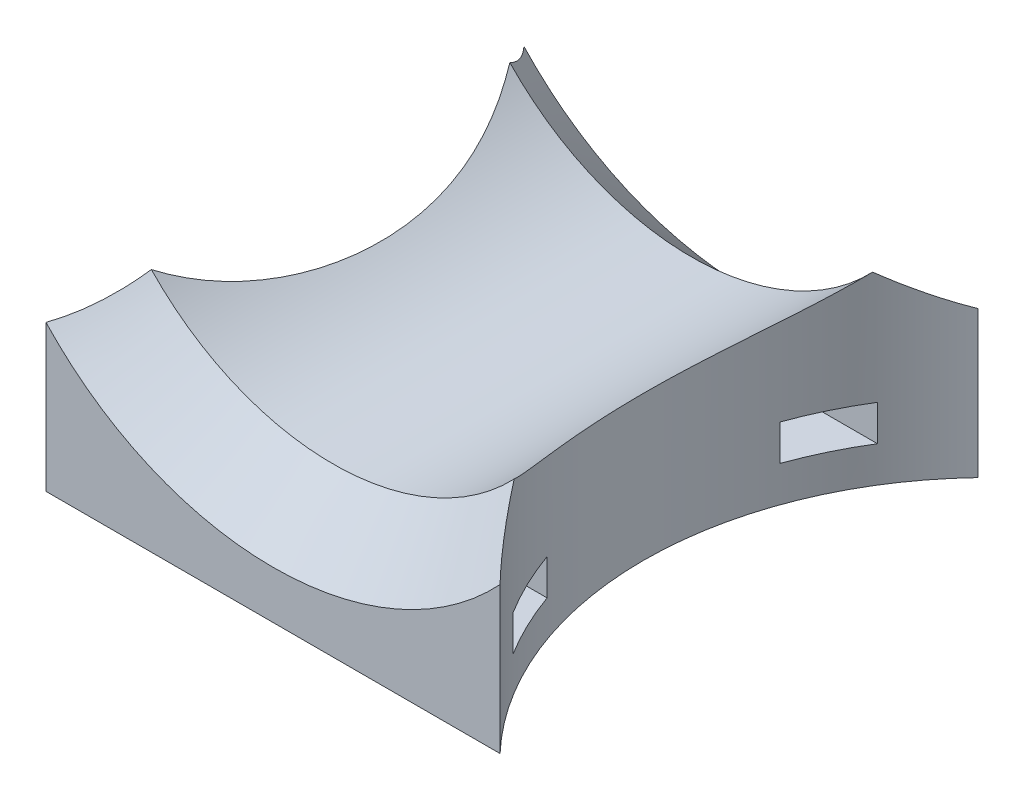
ISO-10303-21;
HEADER;
FILE_DESCRIPTION(('STEP AP214'),'2;1');
FILE_NAME('part.step','',(''),(''),'','','');
FILE_SCHEMA(('AUTOMOTIVE_DESIGN { 1 0 10303 214 1 1 1 1 }'));
ENDSEC;
DATA;
#1=APPLICATION_CONTEXT('core data for automotive mechanical design processes');
#2=APPLICATION_PROTOCOL_DEFINITION('international standard','automotive_design',2000,#1);
#3=PRODUCT_CONTEXT('',#1,'mechanical');
#4=PRODUCT('Part','Part','',(#3));
#5=PRODUCT_RELATED_PRODUCT_CATEGORY('part','',(#4));
#6=PRODUCT_DEFINITION_FORMATION('','',#4);
#7=PRODUCT_DEFINITION_CONTEXT('part definition',#1,'design');
#8=PRODUCT_DEFINITION('design','',#6,#7);
#9=PRODUCT_DEFINITION_SHAPE('','',#8);
#10=(LENGTH_UNIT() NAMED_UNIT(*) SI_UNIT(.MILLI.,.METRE.));
#11=(NAMED_UNIT(*) PLANE_ANGLE_UNIT() SI_UNIT($,.RADIAN.));
#12=(NAMED_UNIT(*) SI_UNIT($,.STERADIAN.) SOLID_ANGLE_UNIT());
#13=UNCERTAINTY_MEASURE_WITH_UNIT(LENGTH_MEASURE(1.E-05),#10,'distance_accuracy_value','');
#14=(GEOMETRIC_REPRESENTATION_CONTEXT(3) GLOBAL_UNCERTAINTY_ASSIGNED_CONTEXT((#13)) GLOBAL_UNIT_ASSIGNED_CONTEXT((#10,
#11,#12)) REPRESENTATION_CONTEXT('',''));
#15=CARTESIAN_POINT('',(0.,0.,0.));
#16=DIRECTION('',(0.,0.,1.));
#17=DIRECTION('',(1.,0.,0.));
#18=AXIS2_PLACEMENT_3D('',#15,#16,#17);
#19=CARTESIAN_POINT('',(40.,-30.,0.));
#20=DIRECTION('',(0.,1.,0.));
#21=DIRECTION('',(0.,0.,1.));
#22=AXIS2_PLACEMENT_3D('',#19,#20,#21);
#23=CYLINDRICAL_SURFACE('',#22,29.);
#24=DIRECTION('',(0.,1.,0.));
#25=VECTOR('',#24,1.);
#26=CARTESIAN_POINT('',(12.6881436002603,-30.,9.75));
#27=LINE('',#26,#25);
#28=CARTESIAN_POINT('',(12.6881436002603,-24.,9.75));
#29=VERTEX_POINT('',#28);
#30=CARTESIAN_POINT('',(12.6881436002603,-27.,9.75));
#31=VERTEX_POINT('',#30);
#32=EDGE_CURVE('E201',#29,#31,#27,.F.);
#33=ORIENTED_EDGE('',*,*,#32,.T.);
#34=CARTESIAN_POINT('',(40.,-27.,0.));
#35=DIRECTION('',(0.,1.,0.));
#36=DIRECTION('',(0.,0.,1.));
#37=AXIS2_PLACEMENT_3D('',#34,#35,#36);
#38=CIRCLE('',#37,29.);
#39=CARTESIAN_POINT('',(15.3334740995008,-27.,15.25));
#40=VERTEX_POINT('',#39);
#41=EDGE_CURVE('E211',#31,#40,#38,.T.);
#42=ORIENTED_EDGE('',*,*,#41,.T.);
#43=DIRECTION('',(0.,1.,0.));
#44=VECTOR('',#43,1.);
#45=CARTESIAN_POINT('',(15.3334740995008,-30.,15.25));
#46=LINE('',#45,#44);
#47=CARTESIAN_POINT('',(15.3334740995008,-24.,15.25));
#48=VERTEX_POINT('',#47);
#49=EDGE_CURVE('E195',#40,#48,#46,.T.);
#50=ORIENTED_EDGE('',*,*,#49,.T.);
#51=CARTESIAN_POINT('',(40.,-24.,0.));
#52=DIRECTION('',(0.,-1.,0.));
#53=DIRECTION('',(0.,0.,-1.));
#54=AXIS2_PLACEMENT_3D('',#51,#52,#53);
#55=CIRCLE('',#54,29.);
#56=EDGE_CURVE('E198',#48,#29,#55,.T.);
#57=ORIENTED_EDGE('',*,*,#56,.T.);
#58=EDGE_LOOP('',(#33,#42,#50,#57));
#59=FACE_BOUND('',#58,.T.);
#60=DIRECTION('',(0.,1.,0.));
#61=VECTOR('',#60,1.);
#62=CARTESIAN_POINT('',(19.,-30.,-20.));
#63=LINE('',#62,#61);
#64=CARTESIAN_POINT('',(19.,-17.7482393492989,-20.));
#65=VERTEX_POINT('',#64);
#66=CARTESIAN_POINT('',(19.,-30.,-20.));
#67=VERTEX_POINT('',#66);
#68=EDGE_CURVE('E276',#65,#67,#63,.F.);
#69=ORIENTED_EDGE('',*,*,#68,.F.);
#70=CARTESIAN_POINT('',(19.,-17.7482393492989,-20.));
#71=CARTESIAN_POINT('',(18.8045868262512,-17.6568386119846,-19.7948205300674));
#72=CARTESIAN_POINT('',(18.613792274645,-17.558432853422,-19.5884607847409));
#73=CARTESIAN_POINT('',(18.2414622058741,-17.3488873673357,-19.1740331252359));
#74=CARTESIAN_POINT('',(18.0599227060194,-17.2377531851807,-18.9659659913146));
#75=CARTESIAN_POINT('',(17.7072974501951,-17.0048321764659,-18.5501797511942));
#76=CARTESIAN_POINT('',(17.5361428460741,-16.8831325454134,-18.3424699760893));
#77=CARTESIAN_POINT('',(17.2026486547946,-16.6293968709386,-17.9262907582243));
#78=CARTESIAN_POINT('',(17.0403100065065,-16.4973597302472,-17.7178212370667));
#79=CARTESIAN_POINT('',(16.5664148326756,-16.0872901704774,-17.0921237510885));
#80=CARTESIAN_POINT('',(16.2677073430761,-15.7951167988339,-16.6742844913208));
#81=CARTESIAN_POINT('',(15.8431358588016,-15.3320259528604,-16.0471297615558));
#82=CARTESIAN_POINT('',(15.7050299337098,-15.1728470912157,-15.8371843397159));
#83=CARTESIAN_POINT('',(15.4368788195647,-14.847029754763,-15.4180059454303));
#84=CARTESIAN_POINT('',(15.3068321916517,-14.6803926207136,-15.2087728521502));
#85=CARTESIAN_POINT('',(15.1806527080183,-14.5102647583887,-15.));
#86=B_SPLINE_CURVE_WITH_KNOTS('',3,(#70,#71,#72,#73,#74,#75,#76,#77,#78,#79,#80,#81,#82,#83,#84,
#85),.UNSPECIFIED.,.F.,.F.,(4,2,2,2,2,2,2,4),(0.,0.892949133559846,1.78551070693732,
2.67130209931057,3.5571876413128,5.32758477733651,6.2198416880776,7.11193883882122),.UNSPECIFIED.);
#87=CARTESIAN_POINT('',(15.1806527080181,-14.5102647583889,-15.0000000000001));
#88=VERTEX_POINT('',#87);
#89=EDGE_CURVE('E43',#65,#88,#86,.T.);
#90=ORIENTED_EDGE('',*,*,#89,.T.);
#91=CARTESIAN_POINT('',(19.,-8.94427190999912,20.));
#92=CARTESIAN_POINT('',(18.9039114104774,-9.14840743725538,19.8991068690403));
#93=CARTESIAN_POINT('',(18.8053033896162,-9.34932262649657,19.7941126506236));
#94=CARTESIAN_POINT('',(18.6036605591897,-9.7443783318733,19.5759730503217));
#95=CARTESIAN_POINT('',(18.5006259651156,-9.93851917696075,19.4628280650454));
#96=CARTESIAN_POINT('',(18.2907985257648,-10.3195923818707,19.2285017453362));
#97=CARTESIAN_POINT('',(18.1840080820448,-10.5065291933814,19.1073255039098));
#98=CARTESIAN_POINT('',(17.9672562491902,-10.8730425341803,18.856978523071));
#99=CARTESIAN_POINT('',(17.8572948412191,-11.0526190197307,18.7278077361635));
#100=CARTESIAN_POINT('',(17.5252191395533,-11.5774395529795,18.3303763519549));
#101=CARTESIAN_POINT('',(17.2993376085445,-11.911607659895,18.0504547416309));
#102=CARTESIAN_POINT('',(16.8427786652544,-12.5488889902828,17.4608744387475));
#103=CARTESIAN_POINT('',(16.6121008456218,-12.8519995629555,17.1512132122372));
#104=CARTESIAN_POINT('',(16.1513426043052,-13.4264473782888,16.5045103112492));
#105=CARTESIAN_POINT('',(15.9212618273074,-13.6978366585375,16.1675150608426));
#106=CARTESIAN_POINT('',(15.4659868994628,-14.209879431563,15.467914660408));
#107=CARTESIAN_POINT('',(15.240792764503,-14.4505328244276,15.1053094271363));
#108=CARTESIAN_POINT('',(14.79919496961,-14.9024761721936,14.3564823488737));
#109=CARTESIAN_POINT('',(14.5828020957074,-15.113730823054,13.970232897821));
#110=CARTESIAN_POINT('',(14.1626930221293,-15.5080997957494,13.1770640079171));
#111=CARTESIAN_POINT('',(13.9589772884338,-15.6912130835409,12.7701438102581));
#112=CARTESIAN_POINT('',(13.5545110573638,-16.0421801762605,11.9111645457387));
#113=CARTESIAN_POINT('',(13.3548128461404,-16.208269991036,11.4578903868487));
#114=CARTESIAN_POINT('',(12.9761582064399,-16.5129763702693,10.5338201388379));
#115=CARTESIAN_POINT('',(12.7972024469182,-16.6515920487733,10.0630234852535));
#116=CARTESIAN_POINT('',(12.4622633404053,-16.903726280157,9.10658564357133));
#117=CARTESIAN_POINT('',(12.3062885832434,-17.0172354566443,8.62093898633375));
#118=CARTESIAN_POINT('',(12.0191333405289,-17.2212494430627,7.63763893565968));
#119=CARTESIAN_POINT('',(11.8879545150981,-17.3117527128564,7.13998474081558));
#120=CARTESIAN_POINT('',(11.6305841121916,-17.4859343793409,6.04534777563613));
#121=CARTESIAN_POINT('',(11.5094739029761,-17.5655022197232,5.44650862418814));
#122=CARTESIAN_POINT('',(11.3050239009771,-17.6977745699956,4.23947808919503));
#123=CARTESIAN_POINT('',(11.2216878287998,-17.7504764337546,3.6312857904984));
#124=CARTESIAN_POINT('',(11.0936845261808,-17.8307567752484,2.40889082375661));
#125=CARTESIAN_POINT('',(11.0490369808312,-17.8583224638297,1.79468525663936));
#126=CARTESIAN_POINT('',(10.9989460356161,-17.8892151423947,0.564070250599289));
#127=CARTESIAN_POINT('',(10.9935040268294,-17.8925412723179,-0.0523392657470109));
#128=CARTESIAN_POINT('',(11.0234523382865,-17.8741144391611,-1.35165825138968));
#129=CARTESIAN_POINT('',(11.0633965028398,-17.8495647160325,-2.03443001010268));
#130=CARTESIAN_POINT('',(11.1911699881013,-17.7697316034707,-3.39372887311614));
#131=CARTESIAN_POINT('',(11.2790036182874,-17.7144454481184,-4.070255409849));
#132=CARTESIAN_POINT('',(11.5014493950904,-17.5708342097346,-5.4125417879236));
#133=CARTESIAN_POINT('',(11.6360929441077,-17.4824869446343,-6.07829408681049));
#134=CARTESIAN_POINT('',(11.9500910619762,-17.2693752217973,-7.39320787113809));
#135=CARTESIAN_POINT('',(12.1294431932539,-17.1446127494044,-8.04237025895688));
#136=CARTESIAN_POINT('',(12.5279934893706,-16.8555463825094,-9.31276528954861));
#137=CARTESIAN_POINT('',(12.7468159850251,-16.6916109182299,-9.93419766856104));
#138=CARTESIAN_POINT('',(13.1022798210491,-16.4119727951245,-10.8452419807606));
#139=CARTESIAN_POINT('',(13.2253378072631,-16.3131107628211,-11.145473205202));
#140=CARTESIAN_POINT('',(13.4798099731396,-16.103475763495,-11.7381175733682));
#141=CARTESIAN_POINT('',(13.6112229692148,-15.9927044820308,-12.0305318161623));
#142=CARTESIAN_POINT('',(13.8813252403014,-15.758827656012,-12.6061787342028));
#143=CARTESIAN_POINT('',(14.0200002207393,-15.6357459386378,-12.8894277938743));
#144=CARTESIAN_POINT('',(14.3038900093229,-15.3764652407931,-13.4464731598977));
#145=CARTESIAN_POINT('',(14.4491044043148,-15.2402670883886,-13.7202700615023));
#146=CARTESIAN_POINT('',(14.7449093423514,-14.954261577987,-14.2574310747668));
#147=CARTESIAN_POINT('',(14.8954967698859,-14.8044620312383,-14.5208010513296));
#148=CARTESIAN_POINT('',(15.2009275844927,-14.4906781986373,-15.036484646203));
#149=CARTESIAN_POINT('',(15.3557719774269,-14.3266905403324,-15.2887956142443));
#150=CARTESIAN_POINT('',(15.7309813376667,-13.9155185299175,-15.8802252807279));
#151=CARTESIAN_POINT('',(15.9527458638638,-13.661321145354,-16.2136311579146));
#152=CARTESIAN_POINT('',(16.397762462832,-13.1238353987813,-16.8548726377232));
#153=CARTESIAN_POINT('',(16.6210141680451,-12.8405539924303,-17.162714322501));
#154=CARTESIAN_POINT('',(17.064231683216,-12.2453825550541,-17.7506577356234));
#155=CARTESIAN_POINT('',(17.2842024605884,-11.9335422888836,-18.0308060133564));
#156=CARTESIAN_POINT('',(17.7165501262211,-11.2816966391159,-18.5624684004249));
#157=CARTESIAN_POINT('',(17.9289304251155,-10.9417041388772,-18.8139954839717));
#158=CARTESIAN_POINT('',(18.2871333498749,-10.3281895519589,-19.2251125672963));
#159=CARTESIAN_POINT('',(18.4357383510364,-10.0607826217684,-19.3914553626246));
#160=CARTESIAN_POINT('',(18.7245561009047,-9.51247760502896,-19.7079004962586));
#161=CARTESIAN_POINT('',(18.8647744616447,-9.23158877216572,-19.858013750354));
#162=CARTESIAN_POINT('',(19.,-8.94427190999916,-20.));
#163=B_SPLINE_CURVE_WITH_KNOTS('',3,(#91,#92,#93,#94,#95,#96,#97,#98,#99,#100,#101,#102,#103,
#104,#105,#106,#107,#108,#109,#110,#111,#112,#113,#114,#115,#116,#117,#118,#119,#120,#121,#122,
#123,#124,#125,#126,#127,#128,#129,#130,#131,#132,#133,#134,#135,#136,#137,#138,#139,#140,#141,
#142,#143,#144,#145,#146,#147,#148,#149,#150,#151,#152,#153,#154,#155,#156,#157,#158,#159,#160,
#161,#162),.UNSPECIFIED.,.F.,.F.,(4,2,2,2,2,2,2,2,2,2,2,2,2,2,2,2,2,2,2,2,2,2,2,2,2,2,2,2,2,2,2,
2,2,2,2,4),(0.,0.741376253193113,1.48271645603477,2.22359095614536,2.96446985817628,
4.43522826864416,5.90611210580667,7.37454810307057,8.84298887361083,10.3131781070179,
11.7834213490437,13.3491728119809,14.9149747572227,16.4813604905413,18.0478510584215,
19.8943074066758,21.7409455842339,23.5885227981666,25.4361655669436,27.4868925306678,
29.537804065697,31.5900941166277,33.6422722983437,35.6758604956514,36.6931264329757,
37.7102485820949,38.7254388214263,39.7405650117771,40.7551118611018,41.7699005298379,
43.1911875229068,44.6121353930285,46.0306526849984,47.448524368541,48.4924893238795,
49.5357476948665),.UNSPECIFIED.);
#164=CARTESIAN_POINT('',(15.1806527080183,-14.5102647583887,15.));
#165=VERTEX_POINT('',#164);
#166=EDGE_CURVE('E217',#165,#88,#163,.T.);
#167=ORIENTED_EDGE('',*,*,#166,.F.);
#168=CARTESIAN_POINT('',(15.1806527080183,-14.5102647583887,15.));
#169=CARTESIAN_POINT('',(15.2915368513939,-14.6597763376227,15.1834684326013));
#170=CARTESIAN_POINT('',(15.405415575833,-14.8065943315214,15.3673018820033));
#171=CARTESIAN_POINT('',(15.6393741766288,-15.0945237395815,15.7355499106167));
#172=CARTESIAN_POINT('',(15.7594550820458,-15.2356341997835,15.9199645814668));
#173=CARTESIAN_POINT('',(16.1298394682152,-15.6504980378453,16.474629419991));
#174=CARTESIAN_POINT('',(16.389767259395,-15.9150804669532,16.8454396077148));
#175=CARTESIAN_POINT('',(16.9322095706892,-16.4119438078037,17.580745215584));
#176=CARTESIAN_POINT('',(17.2143110512324,-16.6446622183528,17.9452493432718));
#177=CARTESIAN_POINT('',(17.8053324743054,-17.0775548326277,18.671243285544));
#178=CARTESIAN_POINT('',(18.1142162749407,-17.2777718787671,19.0327364624892));
#179=CARTESIAN_POINT('',(18.5283197235269,-17.5101789308391,19.4932224614779));
#180=CARTESIAN_POINT('',(18.6209783385757,-17.560017200726,19.5948081468966));
#181=CARTESIAN_POINT('',(18.8087147945036,-17.6565558870561,19.7976908000885));
#182=CARTESIAN_POINT('',(18.9037974462781,-17.7032492638384,19.8989866638933));
#183=CARTESIAN_POINT('',(19.,-17.7482393492988,20.));
#184=B_SPLINE_CURVE_WITH_KNOTS('',3,(#168,#169,#170,#171,#172,#173,#174,#175,#176,#177,#178,
#179,#180,#181,#182,#183),.UNSPECIFIED.,.F.,.F.,(4,2,2,2,2,2,2,4),(0.,0.784017331878552,
1.56816516772788,3.14013216086747,4.68770814272012,6.23322728947603,6.67193826107007,
7.11160069075822),.UNSPECIFIED.);
#185=CARTESIAN_POINT('',(19.,-17.7482393492988,20.));
#186=VERTEX_POINT('',#185);
#187=EDGE_CURVE('E246',#165,#186,#184,.T.);
#188=ORIENTED_EDGE('',*,*,#187,.T.);
#189=DIRECTION('',(0.,1.,0.));
#190=VECTOR('',#189,1.);
#191=CARTESIAN_POINT('',(19.,-30.,20.));
#192=LINE('',#191,#190);
#193=CARTESIAN_POINT('',(19.,-30.,20.));
#194=VERTEX_POINT('',#193);
#195=EDGE_CURVE('E225',#186,#194,#192,.F.);
#196=ORIENTED_EDGE('',*,*,#195,.T.);
#197=CARTESIAN_POINT('',(40.,-30.,0.));
#198=DIRECTION('',(0.,1.,0.));
#199=DIRECTION('',(0.,0.,-1.));
#200=AXIS2_PLACEMENT_3D('',#197,#198,#199);
#201=CIRCLE('',#200,29.);
#202=EDGE_CURVE('E214',#67,#194,#201,.T.);
#203=ORIENTED_EDGE('',*,*,#202,.F.);
#204=EDGE_LOOP('',(#69,#90,#167,#188,#196,#203));
#205=FACE_BOUND('',#204,.T.);
#206=DIRECTION('',(0.,1.,0.));
#207=VECTOR('',#206,1.);
#208=CARTESIAN_POINT('',(15.3334740995007,-30.,-15.25));
#209=LINE('',#208,#207);
#210=CARTESIAN_POINT('',(15.3334740995007,-24.,-15.25));
#211=VERTEX_POINT('',#210);
#212=CARTESIAN_POINT('',(15.3334740995007,-27.,-15.25));
#213=VERTEX_POINT('',#212);
#214=EDGE_CURVE('E145',#211,#213,#209,.F.);
#215=ORIENTED_EDGE('',*,*,#214,.T.);
#216=CARTESIAN_POINT('',(40.,-27.,0.));
#217=DIRECTION('',(0.,1.,0.));
#218=DIRECTION('',(0.,0.,1.));
#219=AXIS2_PLACEMENT_3D('',#216,#217,#218);
#220=CIRCLE('',#219,29.);
#221=CARTESIAN_POINT('',(12.6881436002603,-27.,-9.75));
#222=VERTEX_POINT('',#221);
#223=EDGE_CURVE('E148',#213,#222,#220,.T.);
#224=ORIENTED_EDGE('',*,*,#223,.T.);
#225=DIRECTION('',(0.,1.,0.));
#226=VECTOR('',#225,1.);
#227=CARTESIAN_POINT('',(12.6881436002603,-30.,-9.75));
#228=LINE('',#227,#226);
#229=CARTESIAN_POINT('',(12.6881436002603,-24.,-9.75));
#230=VERTEX_POINT('',#229);
#231=EDGE_CURVE('E171',#222,#230,#228,.T.);
#232=ORIENTED_EDGE('',*,*,#231,.T.);
#233=CARTESIAN_POINT('',(40.,-24.,0.));
#234=DIRECTION('',(0.,-1.,0.));
#235=DIRECTION('',(0.,0.,-1.));
#236=AXIS2_PLACEMENT_3D('',#233,#234,#235);
#237=CIRCLE('',#236,29.);
#238=EDGE_CURVE('E174',#230,#211,#237,.T.);
#239=ORIENTED_EDGE('',*,*,#238,.T.);
#240=EDGE_LOOP('',(#215,#224,#232,#239));
#241=FACE_BOUND('',#240,.T.);
#242=ADVANCED_FACE('F33',(#59,#205,#241),#23,.F.);
#243=CARTESIAN_POINT('',(-27.5,-30.,20.));
#244=DIRECTION('',(0.,1.,0.));
#245=DIRECTION('',(0.,0.,1.));
#246=AXIS2_PLACEMENT_3D('',#243,#244,#245);
#247=PLANE('',#246);
#248=CARTESIAN_POINT('',(0.,-30.,-12.5));
#249=DIRECTION('',(0.,-1.,0.));
#250=DIRECTION('',(0.,0.,1.));
#251=AXIS2_PLACEMENT_3D('',#248,#249,#250);
#252=CIRCLE('',#251,1.8);
#253=CARTESIAN_POINT('',(0.,-30.,-10.7));
#254=VERTEX_POINT('',#253);
#255=EDGE_CURVE('E380',#254,#254,#252,.T.);
#256=ORIENTED_EDGE('',*,*,#255,.F.);
#257=EDGE_LOOP('',(#256));
#258=FACE_BOUND('',#257,.T.);
#259=CARTESIAN_POINT('',(0.,-30.,12.5));
#260=DIRECTION('',(0.,-1.,0.));
#261=DIRECTION('',(0.,0.,-1.));
#262=AXIS2_PLACEMENT_3D('',#259,#260,#261);
#263=CIRCLE('',#262,1.8);
#264=CARTESIAN_POINT('',(0.,-30.,10.7));
#265=VERTEX_POINT('',#264);
#266=EDGE_CURVE('E165',#265,#265,#263,.T.);
#267=ORIENTED_EDGE('',*,*,#266,.F.);
#268=EDGE_LOOP('',(#267));
#269=FACE_BOUND('',#268,.T.);
#270=DIRECTION('',(1.,0.,0.));
#271=VECTOR('',#270,1.);
#272=CARTESIAN_POINT('',(-27.5,-30.,-20.));
#273=LINE('',#272,#271);
#274=CARTESIAN_POINT('',(-19.,-30.,-20.));
#275=VERTEX_POINT('',#274);
#276=EDGE_CURVE('E282',#275,#67,#273,.T.);
#277=ORIENTED_EDGE('',*,*,#276,.T.);
#278=ORIENTED_EDGE('',*,*,#202,.T.);
#279=DIRECTION('',(1.,0.,0.));
#280=VECTOR('',#279,1.);
#281=CARTESIAN_POINT('',(-27.5,-30.,20.));
#282=LINE('',#281,#280);
#283=CARTESIAN_POINT('',(-19.,-30.,20.));
#284=VERTEX_POINT('',#283);
#285=EDGE_CURVE('E281',#284,#194,#282,.T.);
#286=ORIENTED_EDGE('',*,*,#285,.F.);
#287=CARTESIAN_POINT('',(-40.,-30.,0.));
#288=DIRECTION('',(0.,1.,0.));
#289=DIRECTION('',(0.,0.,1.));
#290=AXIS2_PLACEMENT_3D('',#287,#288,#289);
#291=CIRCLE('',#290,29.);
#292=EDGE_CURVE('E295',#284,#275,#291,.T.);
#293=ORIENTED_EDGE('',*,*,#292,.T.);
#294=EDGE_LOOP('',(#277,#278,#286,#293));
#295=FACE_BOUND('',#294,.T.);
#296=ADVANCED_FACE('F235',(#258,#269,#295),#247,.F.);
#297=CARTESIAN_POINT('',(0.,0.,20.));
#298=DIRECTION('',(0.,0.,-1.));
#299=DIRECTION('',(-1.,0.,0.));
#300=AXIS2_PLACEMENT_3D('',#297,#298,#299);
#301=CYLINDRICAL_SURFACE('',#300,21.);
#302=ORIENTED_EDGE('',*,*,#166,.T.);
#303=CARTESIAN_POINT('',(0.,0.,-15.));
#304=DIRECTION('',(0.,0.,1.));
#305=DIRECTION('',(1.,0.,0.));
#306=AXIS2_PLACEMENT_3D('',#303,#304,#305);
#307=CIRCLE('',#306,21.);
#308=CARTESIAN_POINT('',(-15.1806527080183,-14.5102647583887,-15.));
#309=VERTEX_POINT('',#308);
#310=EDGE_CURVE('E271',#88,#309,#307,.F.);
#311=ORIENTED_EDGE('',*,*,#310,.T.);
#312=CARTESIAN_POINT('',(-19.,-8.94427190999918,-20.));
#313=CARTESIAN_POINT('',(-18.9039114104774,-9.14840743725543,-19.8991068690403));
#314=CARTESIAN_POINT('',(-18.8053033896162,-9.34932262649663,-19.7941126506236));
#315=CARTESIAN_POINT('',(-18.6036605591897,-9.74437833187335,-19.5759730503217));
#316=CARTESIAN_POINT('',(-18.5006259651156,-9.9385191769608,-19.4628280650453));
#317=CARTESIAN_POINT('',(-18.2907985257648,-10.3195923818708,-19.2285017453362));
#318=CARTESIAN_POINT('',(-18.1840080820447,-10.5065291933814,-19.1073255039098));
#319=CARTESIAN_POINT('',(-17.9672562491901,-10.8730425341803,-18.856978523071));
#320=CARTESIAN_POINT('',(-17.8572948412191,-11.0526190197307,-18.7278077361635));
#321=CARTESIAN_POINT('',(-17.5252191395533,-11.5774395529795,-18.3303763519549));
#322=CARTESIAN_POINT('',(-17.2993376085445,-11.9116076598951,-18.0504547416308));
#323=CARTESIAN_POINT('',(-16.8427786652544,-12.5488889902829,-17.4608744387475));
#324=CARTESIAN_POINT('',(-16.6121008456218,-12.8519995629555,-17.1512132122372));
#325=CARTESIAN_POINT('',(-16.1513426043052,-13.4264473782888,-16.5045103112492));
#326=CARTESIAN_POINT('',(-15.9212618273073,-13.6978366585376,-16.1675150608426));
#327=CARTESIAN_POINT('',(-15.4659868994628,-14.209879431563,-15.4679146604079));
#328=CARTESIAN_POINT('',(-15.2407927645029,-14.4505328244276,-15.1053094271362));
#329=CARTESIAN_POINT('',(-14.7991949696099,-14.9024761721936,-14.3564823488737));
#330=CARTESIAN_POINT('',(-14.5828020957074,-15.113730823054,-13.9702328978209));
#331=CARTESIAN_POINT('',(-14.1626930221293,-15.5080997957494,-13.177064007917));
#332=CARTESIAN_POINT('',(-13.9589772884338,-15.691213083541,-12.7701438102581));
#333=CARTESIAN_POINT('',(-13.5545110573637,-16.0421801762605,-11.9111645457386));
#334=CARTESIAN_POINT('',(-13.3548128461403,-16.2082699910361,-11.4578903868487));
#335=CARTESIAN_POINT('',(-12.9761582064398,-16.5129763702693,-10.5338201388378));
#336=CARTESIAN_POINT('',(-12.7972024469182,-16.6515920487733,-10.0630234852534));
#337=CARTESIAN_POINT('',(-12.4622633404053,-16.9037262801571,-9.10658564357126));
#338=CARTESIAN_POINT('',(-12.3062885832434,-17.0172354566444,-8.62093898633367));
#339=CARTESIAN_POINT('',(-12.0191333405289,-17.2212494430627,-7.6376389356596));
#340=CARTESIAN_POINT('',(-11.887954515098,-17.3117527128564,-7.1399847408155));
#341=CARTESIAN_POINT('',(-11.6305841121916,-17.4859343793409,-6.04534777563604));
#342=CARTESIAN_POINT('',(-11.5094739029761,-17.5655022197232,-5.44650862418805));
#343=CARTESIAN_POINT('',(-11.3050239009771,-17.6977745699956,-4.23947808919494));
#344=CARTESIAN_POINT('',(-11.2216878287998,-17.7504764337546,-3.63128579049831));
#345=CARTESIAN_POINT('',(-11.0936845261808,-17.8307567752484,-2.40889082375651));
#346=CARTESIAN_POINT('',(-11.0490369808312,-17.8583224638297,-1.79468525663927));
#347=CARTESIAN_POINT('',(-10.9989460356161,-17.8892151423947,-0.564070250599192));
#348=CARTESIAN_POINT('',(-10.9935040268294,-17.8925412723179,0.0523392657471083));
#349=CARTESIAN_POINT('',(-11.0234523382866,-17.8741144391611,1.35165825138978));
#350=CARTESIAN_POINT('',(-11.0633965028398,-17.8495647160325,2.03443001010278));
#351=CARTESIAN_POINT('',(-11.1911699881013,-17.7697316034707,3.39372887311624));
#352=CARTESIAN_POINT('',(-11.2790036182874,-17.7144454481184,4.07025540984909));
#353=CARTESIAN_POINT('',(-11.5014493950904,-17.5708342097346,5.4125417879237));
#354=CARTESIAN_POINT('',(-11.6360929441077,-17.4824869446343,6.07829408681058));
#355=CARTESIAN_POINT('',(-11.9500910619762,-17.2693752217973,7.39320787113818));
#356=CARTESIAN_POINT('',(-12.129443193254,-17.1446127494044,8.04237025895698));
#357=CARTESIAN_POINT('',(-12.5279934893707,-16.8555463825094,9.3127652895487));
#358=CARTESIAN_POINT('',(-12.7468159850251,-16.6916109182299,9.93419766856113));
#359=CARTESIAN_POINT('',(-13.1022798210492,-16.4119727951244,10.8452419807607));
#360=CARTESIAN_POINT('',(-13.2253378072632,-16.3131107628211,11.1454732052021));
#361=CARTESIAN_POINT('',(-13.4798099731397,-16.103475763495,11.7381175733683));
#362=CARTESIAN_POINT('',(-13.6112229692148,-15.9927044820307,12.0305318161624));
#363=CARTESIAN_POINT('',(-13.8813252403015,-15.758827656012,12.6061787342029));
#364=CARTESIAN_POINT('',(-14.0200002207394,-15.6357459386378,12.8894277938744));
#365=CARTESIAN_POINT('',(-14.3038900093229,-15.376465240793,13.4464731598978));
#366=CARTESIAN_POINT('',(-14.4491044043148,-15.2402670883886,13.7202700615023));
#367=CARTESIAN_POINT('',(-14.7449093423515,-14.9542615779869,14.2574310747669));
#368=CARTESIAN_POINT('',(-14.8954967698859,-14.8044620312383,14.5208010513297));
#369=CARTESIAN_POINT('',(-15.2009275844927,-14.4906781986372,15.036484646203));
#370=CARTESIAN_POINT('',(-15.355771977427,-14.3266905403323,15.2887956142444));
#371=CARTESIAN_POINT('',(-15.7309813376667,-13.9155185299175,15.8802252807279));
#372=CARTESIAN_POINT('',(-15.9527458638638,-13.6613211453539,16.2136311579147));
#373=CARTESIAN_POINT('',(-16.3977624628321,-13.1238353987812,16.8548726377233));
#374=CARTESIAN_POINT('',(-16.6210141680452,-12.8405539924303,17.1627143225011));
#375=CARTESIAN_POINT('',(-17.064231683216,-12.2453825550541,17.7506577356234));
#376=CARTESIAN_POINT('',(-17.2842024605885,-11.9335422888835,18.0308060133564));
#377=CARTESIAN_POINT('',(-17.7165501262211,-11.2816966391158,18.562468400425));
#378=CARTESIAN_POINT('',(-17.9289304251155,-10.9417041388772,18.8139954839718));
#379=CARTESIAN_POINT('',(-18.2871333498749,-10.3281895519588,19.2251125672964));
#380=CARTESIAN_POINT('',(-18.4357383510364,-10.0607826217683,19.3914553626246));
#381=CARTESIAN_POINT('',(-18.7245561009047,-9.51247760502894,19.7079004962586));
#382=CARTESIAN_POINT('',(-18.8647744616447,-9.23158877216571,19.858013750354));
#383=CARTESIAN_POINT('',(-19.,-8.94427190999917,20.));
#384=B_SPLINE_CURVE_WITH_KNOTS('',3,(#312,#313,#314,#315,#316,#317,#318,#319,#320,#321,#322,
#323,#324,#325,#326,#327,#328,#329,#330,#331,#332,#333,#334,#335,#336,#337,#338,#339,#340,#341,
#342,#343,#344,#345,#346,#347,#348,#349,#350,#351,#352,#353,#354,#355,#356,#357,#358,#359,#360,
#361,#362,#363,#364,#365,#366,#367,#368,#369,#370,#371,#372,#373,#374,#375,#376,#377,#378,#379,
#380,#381,#382,#383),.UNSPECIFIED.,.F.,.F.,(4,2,2,2,2,2,2,2,2,2,2,2,2,2,2,2,2,2,2,2,2,2,2,2,2,2,
2,2,2,2,2,2,2,2,2,4),(0.,0.741376253193117,1.48271645603477,2.22359095614535,2.96446985817628,
4.43522826864416,5.90611210580668,7.37454810307059,8.84298887361084,10.3131781070179,
11.7834213490437,13.349172811981,14.9149747572228,16.4813604905413,18.0478510584216,
19.8943074066758,21.740945584234,23.5885227981667,25.4361655669437,27.4868925306678,
29.537804065697,31.5900941166278,33.6422722983437,35.6758604956515,36.6931264329758,
37.710248582095,38.7254388214264,39.7405650117771,40.7551118611019,41.769900529838,
43.1911875229068,44.6121353930285,46.0306526849985,47.448524368541,48.4924893238795,
49.5357476948664),.UNSPECIFIED.);
#385=CARTESIAN_POINT('',(-15.1806527080183,-14.5102647583887,15.));
#386=VERTEX_POINT('',#385);
#387=EDGE_CURVE('E290',#309,#386,#384,.T.);
#388=ORIENTED_EDGE('',*,*,#387,.T.);
#389=CARTESIAN_POINT('',(0.,0.,15.));
#390=DIRECTION('',(0.,0.,1.));
#391=DIRECTION('',(1.,0.,0.));
#392=AXIS2_PLACEMENT_3D('',#389,#390,#391);
#393=CIRCLE('',#392,21.);
#394=EDGE_CURVE('E274',#386,#165,#393,.T.);
#395=ORIENTED_EDGE('',*,*,#394,.T.);
#396=EDGE_LOOP('',(#302,#311,#388,#395));
#397=FACE_BOUND('',#396,.T.);
#398=ADVANCED_FACE('F227',(#397),#301,.F.);
#399=CARTESIAN_POINT('',(0.,0.,20.));
#400=DIRECTION('',(0.,0.,1.));
#401=DIRECTION('',(1.,0.,0.));
#402=AXIS2_PLACEMENT_3D('',#399,#400,#401);
#403=PLANE('',#402);
#404=ORIENTED_EDGE('',*,*,#195,.F.);
#405=CARTESIAN_POINT('',(0.,0.,20.));
#406=DIRECTION('',(0.,0.,1.));
#407=DIRECTION('',(1.,0.,0.));
#408=AXIS2_PLACEMENT_3D('',#405,#406,#407);
#409=CIRCLE('',#408,26.);
#410=CARTESIAN_POINT('',(-19.,-17.7482393492988,20.));
#411=VERTEX_POINT('',#410);
#412=EDGE_CURVE('E11',#186,#411,#409,.F.);
#413=ORIENTED_EDGE('',*,*,#412,.T.);
#414=DIRECTION('',(0.,1.,0.));
#415=VECTOR('',#414,1.);
#416=CARTESIAN_POINT('',(-19.,-30.,20.));
#417=LINE('',#416,#415);
#418=EDGE_CURVE('E285',#284,#411,#417,.T.);
#419=ORIENTED_EDGE('',*,*,#418,.F.);
#420=ORIENTED_EDGE('',*,*,#285,.T.);
#421=EDGE_LOOP('',(#404,#413,#419,#420));
#422=FACE_BOUND('',#421,.T.);
#423=ADVANCED_FACE('F310',(#422),#403,.T.);
#424=CARTESIAN_POINT('',(0.,0.,-20.));
#425=DIRECTION('',(0.,0.,1.));
#426=DIRECTION('',(1.,0.,0.));
#427=AXIS2_PLACEMENT_3D('',#424,#425,#426);
#428=PLANE('',#427);
#429=DIRECTION('',(0.,1.,0.));
#430=VECTOR('',#429,1.);
#431=CARTESIAN_POINT('',(-19.,-30.,-20.));
#432=LINE('',#431,#430);
#433=CARTESIAN_POINT('',(-19.,-17.7482393492989,-20.));
#434=VERTEX_POINT('',#433);
#435=EDGE_CURVE('E278',#275,#434,#432,.T.);
#436=ORIENTED_EDGE('',*,*,#435,.T.);
#437=CARTESIAN_POINT('',(0.,0.,-20.));
#438=DIRECTION('',(0.,0.,1.));
#439=DIRECTION('',(1.,0.,0.));
#440=AXIS2_PLACEMENT_3D('',#437,#438,#439);
#441=CIRCLE('',#440,26.);
#442=EDGE_CURVE('E251',#434,#65,#441,.T.);
#443=ORIENTED_EDGE('',*,*,#442,.T.);
#444=ORIENTED_EDGE('',*,*,#68,.T.);
#445=ORIENTED_EDGE('',*,*,#276,.F.);
#446=EDGE_LOOP('',(#436,#443,#444,#445));
#447=FACE_BOUND('',#446,.T.);
#448=ADVANCED_FACE('F315',(#447),#428,.F.);
#449=CARTESIAN_POINT('',(-40.,-30.,0.));
#450=DIRECTION('',(0.,1.,0.));
#451=DIRECTION('',(0.,0.,1.));
#452=AXIS2_PLACEMENT_3D('',#449,#450,#451);
#453=CYLINDRICAL_SURFACE('',#452,29.);
#454=ORIENTED_EDGE('',*,*,#387,.F.);
#455=CARTESIAN_POINT('',(-15.1806527080183,-14.5102647583887,-15.));
#456=CARTESIAN_POINT('',(-15.2915368513939,-14.6597763376227,-15.1834684326014));
#457=CARTESIAN_POINT('',(-15.405415575833,-14.8065943315214,-15.3673018820033));
#458=CARTESIAN_POINT('',(-15.6393741766288,-15.0945237395815,-15.7355499106167));
#459=CARTESIAN_POINT('',(-15.7594550820458,-15.2356341997835,-15.9199645814668));
#460=CARTESIAN_POINT('',(-16.1298394682152,-15.6504980378453,-16.474629419991));
#461=CARTESIAN_POINT('',(-16.389767259395,-15.9150804669532,-16.8454396077148));
#462=CARTESIAN_POINT('',(-16.9322095706892,-16.4119438078037,-17.580745215584));
#463=CARTESIAN_POINT('',(-17.2143110512324,-16.6446622183528,-17.9452493432718));
#464=CARTESIAN_POINT('',(-17.8053324743054,-17.0775548326278,-18.671243285544));
#465=CARTESIAN_POINT('',(-18.1142162749407,-17.2777718787671,-19.0327364624892));
#466=CARTESIAN_POINT('',(-18.5283197235269,-17.5101789308391,-19.4932224614779));
#467=CARTESIAN_POINT('',(-18.6209783385757,-17.560017200726,-19.5948081468966));
#468=CARTESIAN_POINT('',(-18.8087147945036,-17.6565558870561,-19.7976908000885));
#469=CARTESIAN_POINT('',(-18.9037974462781,-17.7032492638384,-19.8989866638933));
#470=CARTESIAN_POINT('',(-19.,-17.7482393492989,-20.));
#471=B_SPLINE_CURVE_WITH_KNOTS('',3,(#455,#456,#457,#458,#459,#460,#461,#462,#463,#464,#465,
#466,#467,#468,#469,#470),.UNSPECIFIED.,.F.,.F.,(4,2,2,2,2,2,2,4),(0.,0.784017331878547,
1.56816516772788,3.14013216086746,4.68770814272011,6.23322728947602,6.67193826107006,
7.11160069075821),.UNSPECIFIED.);
#472=EDGE_CURVE('E261',#309,#434,#471,.T.);
#473=ORIENTED_EDGE('',*,*,#472,.T.);
#474=ORIENTED_EDGE('',*,*,#435,.F.);
#475=ORIENTED_EDGE('',*,*,#292,.F.);
#476=ORIENTED_EDGE('',*,*,#418,.T.);
#477=CARTESIAN_POINT('',(-19.,-17.7482393492988,20.));
#478=CARTESIAN_POINT('',(-18.8045868262512,-17.6568386119846,19.7948205300674));
#479=CARTESIAN_POINT('',(-18.613792274645,-17.558432853422,19.5884607847409));
#480=CARTESIAN_POINT('',(-18.2414622058741,-17.3488873673357,19.1740331252359));
#481=CARTESIAN_POINT('',(-18.0599227060194,-17.2377531851806,18.9659659913146));
#482=CARTESIAN_POINT('',(-17.7072974501951,-17.0048321764658,18.5501797511942));
#483=CARTESIAN_POINT('',(-17.5361428460741,-16.8831325454134,18.3424699760893));
#484=CARTESIAN_POINT('',(-17.2026486547946,-16.6293968709386,17.9262907582243));
#485=CARTESIAN_POINT('',(-17.0403100065065,-16.4973597302472,17.7178212370666));
#486=CARTESIAN_POINT('',(-16.5664148326756,-16.0872901704774,17.0921237510885));
#487=CARTESIAN_POINT('',(-16.2677073430761,-15.7951167988339,16.6742844913208));
#488=CARTESIAN_POINT('',(-15.8431358588016,-15.3320259528604,16.0471297615558));
#489=CARTESIAN_POINT('',(-15.7050299337098,-15.1728470912157,15.8371843397159));
#490=CARTESIAN_POINT('',(-15.4368788195647,-14.847029754763,15.4180059454303));
#491=CARTESIAN_POINT('',(-15.3068321916517,-14.6803926207136,15.2087728521501));
#492=CARTESIAN_POINT('',(-15.1806527080183,-14.5102647583887,15.));
#493=B_SPLINE_CURVE_WITH_KNOTS('',3,(#477,#478,#479,#480,#481,#482,#483,#484,#485,#486,#487,
#488,#489,#490,#491,#492),.UNSPECIFIED.,.F.,.F.,(4,2,2,2,2,2,2,4),(0.,0.892949133559845,
1.78551070693732,2.67130209931057,3.5571876413128,5.3275847773365,6.2198416880776,
7.11193883882122),.UNSPECIFIED.);
#494=EDGE_CURVE('E266',#411,#386,#493,.T.);
#495=ORIENTED_EDGE('',*,*,#494,.T.);
#496=EDGE_LOOP('',(#454,#473,#474,#475,#476,#495));
#497=FACE_BOUND('',#496,.T.);
#498=ADVANCED_FACE('F239',(#497),#453,.F.);
#499=CARTESIAN_POINT('',(0.,0.,-15.));
#500=DIRECTION('',(0.,0.,-1.));
#501=DIRECTION('',(-1.,0.,0.));
#502=AXIS2_PLACEMENT_3D('',#499,#500,#501);
#503=CONICAL_SURFACE('',#502,21.,0.785398163397451);
#504=ORIENTED_EDGE('',*,*,#89,.F.);
#505=ORIENTED_EDGE('',*,*,#442,.F.);
#506=ORIENTED_EDGE('',*,*,#472,.F.);
#507=ORIENTED_EDGE('',*,*,#310,.F.);
#508=EDGE_LOOP('',(#504,#505,#506,#507));
#509=FACE_BOUND('',#508,.T.);
#510=ADVANCED_FACE('F256',(#509),#503,.F.);
#511=CARTESIAN_POINT('',(0.,0.,20.));
#512=DIRECTION('',(0.,0.,1.));
#513=DIRECTION('',(1.,0.,0.));
#514=AXIS2_PLACEMENT_3D('',#511,#512,#513);
#515=CONICAL_SURFACE('',#514,26.,0.785398163397446);
#516=ORIENTED_EDGE('',*,*,#187,.F.);
#517=ORIENTED_EDGE('',*,*,#394,.F.);
#518=ORIENTED_EDGE('',*,*,#494,.F.);
#519=ORIENTED_EDGE('',*,*,#412,.F.);
#520=EDGE_LOOP('',(#516,#517,#518,#519));
#521=FACE_BOUND('',#520,.T.);
#522=ADVANCED_FACE('F35',(#521),#515,.F.);
#523=CARTESIAN_POINT('',(19.001,-24.,9.75));
#524=DIRECTION('',(0.,0.,1.));
#525=DIRECTION('',(1.,0.,0.));
#526=AXIS2_PLACEMENT_3D('',#523,#524,#525);
#527=PLANE('',#526);
#528=DIRECTION('',(-1.,0.,0.));
#529=VECTOR('',#528,1.);
#530=CARTESIAN_POINT('',(19.001,-24.,9.75));
#531=LINE('',#530,#529);
#532=CARTESIAN_POINT('',(-3.,-24.,9.75));
#533=VERTEX_POINT('',#532);
#534=EDGE_CURVE('E209',#29,#533,#531,.T.);
#535=ORIENTED_EDGE('',*,*,#534,.T.);
#536=DIRECTION('',(0.,1.,0.));
#537=VECTOR('',#536,1.);
#538=CARTESIAN_POINT('',(-3.,-24.,9.75));
#539=LINE('',#538,#537);
#540=CARTESIAN_POINT('',(-3.,-27.,9.75));
#541=VERTEX_POINT('',#540);
#542=EDGE_CURVE('E183',#541,#533,#539,.T.);
#543=ORIENTED_EDGE('',*,*,#542,.F.);
#544=DIRECTION('',(-1.,0.,0.));
#545=VECTOR('',#544,1.);
#546=CARTESIAN_POINT('',(19.001,-27.,9.75));
#547=LINE('',#546,#545);
#548=EDGE_CURVE('E204',#31,#541,#547,.T.);
#549=ORIENTED_EDGE('',*,*,#548,.F.);
#550=ORIENTED_EDGE('',*,*,#32,.F.);
#551=EDGE_LOOP('',(#535,#543,#549,#550));
#552=FACE_BOUND('',#551,.T.);
#553=ADVANCED_FACE('F237',(#552),#527,.T.);
#554=CARTESIAN_POINT('',(19.001,-24.,15.25));
#555=DIRECTION('',(0.,-1.,0.));
#556=DIRECTION('',(0.,0.,-1.));
#557=AXIS2_PLACEMENT_3D('',#554,#555,#556);
#558=PLANE('',#557);
#559=DIRECTION('',(-1.,0.,0.));
#560=VECTOR('',#559,1.);
#561=CARTESIAN_POINT('',(19.001,-24.,15.25));
#562=LINE('',#561,#560);
#563=CARTESIAN_POINT('',(-3.,-24.,15.25));
#564=VERTEX_POINT('',#563);
#565=EDGE_CURVE('E207',#48,#564,#562,.T.);
#566=ORIENTED_EDGE('',*,*,#565,.T.);
#567=DIRECTION('',(0.,0.,1.));
#568=VECTOR('',#567,1.);
#569=CARTESIAN_POINT('',(-3.,-24.,15.25));
#570=LINE('',#569,#568);
#571=EDGE_CURVE('E186',#533,#564,#570,.T.);
#572=ORIENTED_EDGE('',*,*,#571,.F.);
#573=ORIENTED_EDGE('',*,*,#534,.F.);
#574=ORIENTED_EDGE('',*,*,#56,.F.);
#575=EDGE_LOOP('',(#566,#572,#573,#574));
#576=FACE_BOUND('',#575,.T.);
#577=ADVANCED_FACE('F325',(#576),#558,.T.);
#578=CARTESIAN_POINT('',(19.001,-24.,15.25));
#579=DIRECTION('',(0.,0.,-1.));
#580=DIRECTION('',(-1.,0.,0.));
#581=AXIS2_PLACEMENT_3D('',#578,#579,#580);
#582=PLANE('',#581);
#583=DIRECTION('',(-1.,0.,0.));
#584=VECTOR('',#583,1.);
#585=CARTESIAN_POINT('',(19.001,-27.,15.25));
#586=LINE('',#585,#584);
#587=CARTESIAN_POINT('',(-3.,-27.,15.25));
#588=VERTEX_POINT('',#587);
#589=EDGE_CURVE('E59',#40,#588,#586,.T.);
#590=ORIENTED_EDGE('',*,*,#589,.T.);
#591=DIRECTION('',(0.,-1.,0.));
#592=VECTOR('',#591,1.);
#593=CARTESIAN_POINT('',(-3.,-24.,15.25));
#594=LINE('',#593,#592);
#595=EDGE_CURVE('E189',#564,#588,#594,.T.);
#596=ORIENTED_EDGE('',*,*,#595,.F.);
#597=ORIENTED_EDGE('',*,*,#565,.F.);
#598=ORIENTED_EDGE('',*,*,#49,.F.);
#599=EDGE_LOOP('',(#590,#596,#597,#598));
#600=FACE_BOUND('',#599,.T.);
#601=ADVANCED_FACE('F330',(#600),#582,.T.);
#602=CARTESIAN_POINT('',(19.001,-27.,15.25));
#603=DIRECTION('',(0.,1.,0.));
#604=DIRECTION('',(0.,0.,1.));
#605=AXIS2_PLACEMENT_3D('',#602,#603,#604);
#606=PLANE('',#605);
#607=CARTESIAN_POINT('',(0.,-27.,12.5));
#608=DIRECTION('',(0.,1.,0.));
#609=DIRECTION('',(0.,0.,1.));
#610=AXIS2_PLACEMENT_3D('',#607,#608,#609);
#611=CIRCLE('',#610,1.8);
#612=CARTESIAN_POINT('',(0.,-27.,14.3));
#613=VERTEX_POINT('',#612);
#614=EDGE_CURVE('E162',#613,#613,#611,.T.);
#615=ORIENTED_EDGE('',*,*,#614,.F.);
#616=EDGE_LOOP('',(#615));
#617=FACE_BOUND('',#616,.T.);
#618=ORIENTED_EDGE('',*,*,#548,.T.);
#619=DIRECTION('',(0.,0.,-1.));
#620=VECTOR('',#619,1.);
#621=CARTESIAN_POINT('',(-3.,-27.,15.25));
#622=LINE('',#621,#620);
#623=EDGE_CURVE('E192',#588,#541,#622,.T.);
#624=ORIENTED_EDGE('',*,*,#623,.F.);
#625=ORIENTED_EDGE('',*,*,#589,.F.);
#626=ORIENTED_EDGE('',*,*,#41,.F.);
#627=EDGE_LOOP('',(#618,#624,#625,#626));
#628=FACE_BOUND('',#627,.T.);
#629=ADVANCED_FACE('F340',(#617,#628),#606,.T.);
#630=CARTESIAN_POINT('',(-3.,0.,0.));
#631=DIRECTION('',(1.,0.,0.));
#632=DIRECTION('',(0.,0.,-1.));
#633=AXIS2_PLACEMENT_3D('',#630,#631,#632);
#634=PLANE('',#633);
#635=ORIENTED_EDGE('',*,*,#542,.T.);
#636=ORIENTED_EDGE('',*,*,#571,.T.);
#637=ORIENTED_EDGE('',*,*,#595,.T.);
#638=ORIENTED_EDGE('',*,*,#623,.T.);
#639=EDGE_LOOP('',(#635,#636,#637,#638));
#640=FACE_BOUND('',#639,.T.);
#641=ADVANCED_FACE('F339',(#640),#634,.T.);
#642=CARTESIAN_POINT('',(19.001,-24.,-15.25));
#643=DIRECTION('',(0.,0.,1.));
#644=DIRECTION('',(1.,0.,0.));
#645=AXIS2_PLACEMENT_3D('',#642,#643,#644);
#646=PLANE('',#645);
#647=DIRECTION('',(-1.,0.,0.));
#648=VECTOR('',#647,1.);
#649=CARTESIAN_POINT('',(19.001,-24.,-15.25));
#650=LINE('',#649,#648);
#651=CARTESIAN_POINT('',(-3.,-24.,-15.25));
#652=VERTEX_POINT('',#651);
#653=EDGE_CURVE('E137',#211,#652,#650,.T.);
#654=ORIENTED_EDGE('',*,*,#653,.T.);
#655=DIRECTION('',(0.,1.,0.));
#656=VECTOR('',#655,1.);
#657=CARTESIAN_POINT('',(-3.,-24.,-15.25));
#658=LINE('',#657,#656);
#659=CARTESIAN_POINT('',(-3.,-27.,-15.25));
#660=VERTEX_POINT('',#659);
#661=EDGE_CURVE('E142',#660,#652,#658,.T.);
#662=ORIENTED_EDGE('',*,*,#661,.F.);
#663=DIRECTION('',(-1.,0.,0.));
#664=VECTOR('',#663,1.);
#665=CARTESIAN_POINT('',(19.001,-27.,-15.25));
#666=LINE('',#665,#664);
#667=EDGE_CURVE('E177',#213,#660,#666,.T.);
#668=ORIENTED_EDGE('',*,*,#667,.F.);
#669=ORIENTED_EDGE('',*,*,#214,.F.);
#670=EDGE_LOOP('',(#654,#662,#668,#669));
#671=FACE_BOUND('',#670,.T.);
#672=ADVANCED_FACE('F139',(#671),#646,.T.);
#673=CARTESIAN_POINT('',(19.001,-24.,-15.25));
#674=DIRECTION('',(0.,-1.,0.));
#675=DIRECTION('',(0.,0.,-1.));
#676=AXIS2_PLACEMENT_3D('',#673,#674,#675);
#677=PLANE('',#676);
#678=DIRECTION('',(-1.,0.,0.));
#679=VECTOR('',#678,1.);
#680=CARTESIAN_POINT('',(19.001,-24.,-9.75));
#681=LINE('',#680,#679);
#682=CARTESIAN_POINT('',(-3.,-24.,-9.75));
#683=VERTEX_POINT('',#682);
#684=EDGE_CURVE('E149',#230,#683,#681,.T.);
#685=ORIENTED_EDGE('',*,*,#684,.T.);
#686=DIRECTION('',(0.,0.,1.));
#687=VECTOR('',#686,1.);
#688=CARTESIAN_POINT('',(-3.,-24.,-15.25));
#689=LINE('',#688,#687);
#690=EDGE_CURVE('E152',#652,#683,#689,.T.);
#691=ORIENTED_EDGE('',*,*,#690,.F.);
#692=ORIENTED_EDGE('',*,*,#653,.F.);
#693=ORIENTED_EDGE('',*,*,#238,.F.);
#694=EDGE_LOOP('',(#685,#691,#692,#693));
#695=FACE_BOUND('',#694,.T.);
#696=ADVANCED_FACE('F153',(#695),#677,.T.);
#697=CARTESIAN_POINT('',(19.001,-24.,-9.75));
#698=DIRECTION('',(0.,0.,-1.));
#699=DIRECTION('',(-1.,0.,0.));
#700=AXIS2_PLACEMENT_3D('',#697,#698,#699);
#701=PLANE('',#700);
#702=DIRECTION('',(-1.,0.,0.));
#703=VECTOR('',#702,1.);
#704=CARTESIAN_POINT('',(19.001,-27.,-9.75));
#705=LINE('',#704,#703);
#706=CARTESIAN_POINT('',(-3.,-27.,-9.75));
#707=VERTEX_POINT('',#706);
#708=EDGE_CURVE('E51',#222,#707,#705,.T.);
#709=ORIENTED_EDGE('',*,*,#708,.T.);
#710=DIRECTION('',(0.,-1.,0.));
#711=VECTOR('',#710,1.);
#712=CARTESIAN_POINT('',(-3.,-24.,-9.75));
#713=LINE('',#712,#711);
#714=EDGE_CURVE('E158',#683,#707,#713,.T.);
#715=ORIENTED_EDGE('',*,*,#714,.F.);
#716=ORIENTED_EDGE('',*,*,#684,.F.);
#717=ORIENTED_EDGE('',*,*,#231,.F.);
#718=EDGE_LOOP('',(#709,#715,#716,#717));
#719=FACE_BOUND('',#718,.T.);
#720=ADVANCED_FACE('F356',(#719),#701,.T.);
#721=CARTESIAN_POINT('',(19.001,-27.,-15.25));
#722=DIRECTION('',(0.,1.,0.));
#723=DIRECTION('',(0.,0.,1.));
#724=AXIS2_PLACEMENT_3D('',#721,#722,#723);
#725=PLANE('',#724);
#726=CARTESIAN_POINT('',(0.,-27.,-12.5));
#727=DIRECTION('',(0.,1.,0.));
#728=DIRECTION('',(0.,0.,1.));
#729=AXIS2_PLACEMENT_3D('',#726,#727,#728);
#730=CIRCLE('',#729,1.8);
#731=CARTESIAN_POINT('',(0.,-27.,-10.7));
#732=VERTEX_POINT('',#731);
#733=EDGE_CURVE('E38',#732,#732,#730,.T.);
#734=ORIENTED_EDGE('',*,*,#733,.F.);
#735=EDGE_LOOP('',(#734));
#736=FACE_BOUND('',#735,.T.);
#737=ORIENTED_EDGE('',*,*,#667,.T.);
#738=DIRECTION('',(0.,0.,-1.));
#739=VECTOR('',#738,1.);
#740=CARTESIAN_POINT('',(-3.,-27.,-15.25));
#741=LINE('',#740,#739);
#742=EDGE_CURVE('E161',#707,#660,#741,.T.);
#743=ORIENTED_EDGE('',*,*,#742,.F.);
#744=ORIENTED_EDGE('',*,*,#708,.F.);
#745=ORIENTED_EDGE('',*,*,#223,.F.);
#746=EDGE_LOOP('',(#737,#743,#744,#745));
#747=FACE_BOUND('',#746,.T.);
#748=ADVANCED_FACE('F359',(#736,#747),#725,.T.);
#749=CARTESIAN_POINT('',(-3.,0.,0.));
#750=DIRECTION('',(-1.,0.,0.));
#751=DIRECTION('',(0.,0.,1.));
#752=AXIS2_PLACEMENT_3D('',#749,#750,#751);
#753=PLANE('',#752);
#754=ORIENTED_EDGE('',*,*,#661,.T.);
#755=ORIENTED_EDGE('',*,*,#690,.T.);
#756=ORIENTED_EDGE('',*,*,#714,.T.);
#757=ORIENTED_EDGE('',*,*,#742,.T.);
#758=EDGE_LOOP('',(#754,#755,#756,#757));
#759=FACE_BOUND('',#758,.T.);
#760=ADVANCED_FACE('F160',(#759),#753,.F.);
#761=CARTESIAN_POINT('',(0.,-24.,12.5));
#762=DIRECTION('',(0.,-1.,0.));
#763=DIRECTION('',(0.,0.,-1.));
#764=AXIS2_PLACEMENT_3D('',#761,#762,#763);
#765=CYLINDRICAL_SURFACE('',#764,1.8);
#766=ORIENTED_EDGE('',*,*,#614,.T.);
#767=EDGE_LOOP('',(#766));
#768=FACE_BOUND('',#767,.T.);
#769=ORIENTED_EDGE('',*,*,#266,.T.);
#770=EDGE_LOOP('',(#769));
#771=FACE_BOUND('',#770,.T.);
#772=ADVANCED_FACE('F366',(#768,#771),#765,.F.);
#773=CARTESIAN_POINT('',(0.,-24.,-12.5));
#774=DIRECTION('',(0.,-1.,0.));
#775=DIRECTION('',(0.,0.,-1.));
#776=AXIS2_PLACEMENT_3D('',#773,#774,#775);
#777=CYLINDRICAL_SURFACE('',#776,1.8);
#778=ORIENTED_EDGE('',*,*,#733,.T.);
#779=EDGE_LOOP('',(#778));
#780=FACE_BOUND('',#779,.T.);
#781=ORIENTED_EDGE('',*,*,#255,.T.);
#782=EDGE_LOOP('',(#781));
#783=FACE_BOUND('',#782,.T.);
#784=ADVANCED_FACE('F369',(#780,#783),#777,.F.);
#785=CLOSED_SHELL('',(#242,#296,#398,#423,#448,#498,#510,#522,#553,#577,#601,#629,#641,#672,
#696,#720,#748,#760,#772,#784));
#786=MANIFOLD_SOLID_BREP('B2',#785);
#787=ADVANCED_BREP_SHAPE_REPRESENTATION('',(#18,#786),#14);
#788=SHAPE_DEFINITION_REPRESENTATION(#9,#787);
ENDSEC;
END-ISO-10303-21;
